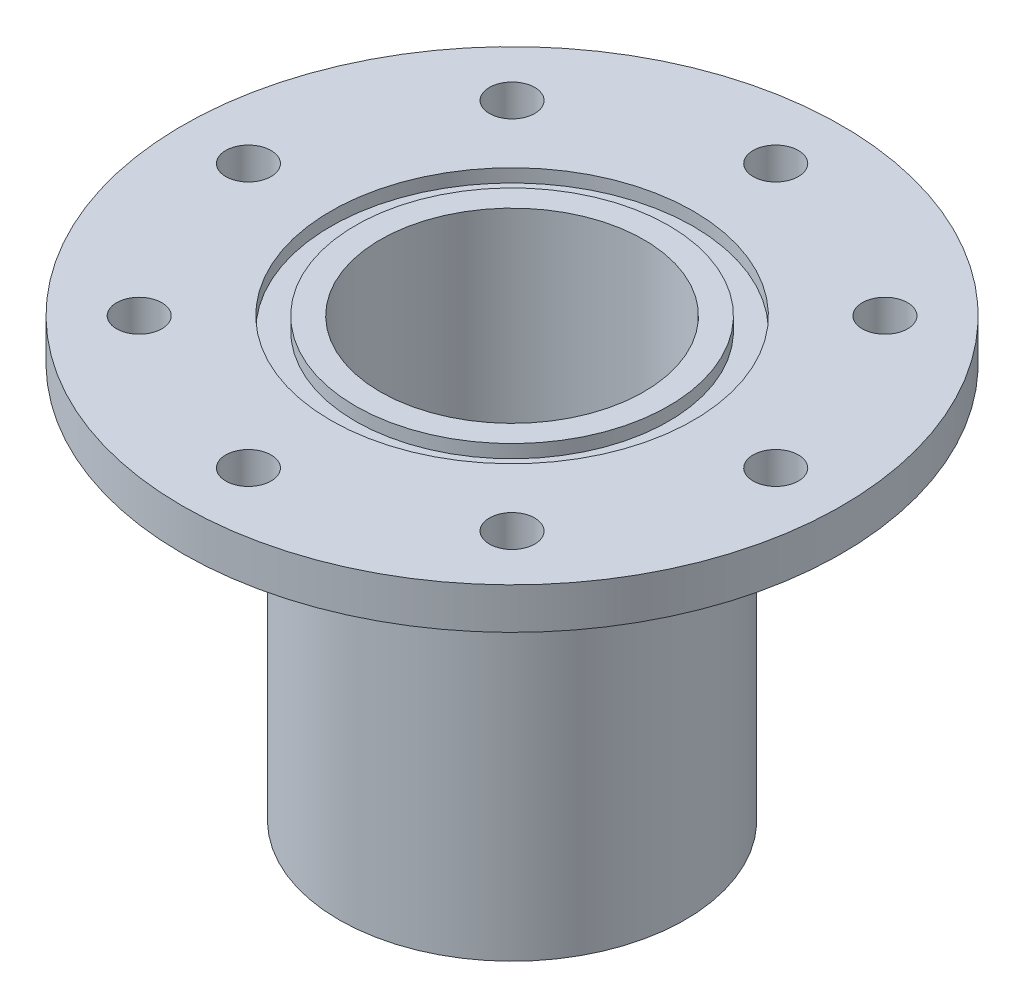
ISO-10303-21;
HEADER;
FILE_DESCRIPTION(('STEP AP214'),'2;1');
FILE_NAME('part.step','',(''),(''),'','','');
FILE_SCHEMA(('AUTOMOTIVE_DESIGN { 1 0 10303 214 1 1 1 1 }'));
ENDSEC;
DATA;
#1=APPLICATION_CONTEXT('core data for automotive mechanical design processes');
#2=APPLICATION_PROTOCOL_DEFINITION('international standard','automotive_design',2000,#1);
#3=PRODUCT_CONTEXT('',#1,'mechanical');
#4=PRODUCT('Part','Part','',(#3));
#5=PRODUCT_RELATED_PRODUCT_CATEGORY('part','',(#4));
#6=PRODUCT_DEFINITION_FORMATION('','',#4);
#7=PRODUCT_DEFINITION_CONTEXT('part definition',#1,'design');
#8=PRODUCT_DEFINITION('design','',#6,#7);
#9=PRODUCT_DEFINITION_SHAPE('','',#8);
#10=(LENGTH_UNIT() NAMED_UNIT(*) SI_UNIT(.MILLI.,.METRE.));
#11=(NAMED_UNIT(*) PLANE_ANGLE_UNIT() SI_UNIT($,.RADIAN.));
#12=(NAMED_UNIT(*) SI_UNIT($,.STERADIAN.) SOLID_ANGLE_UNIT());
#13=UNCERTAINTY_MEASURE_WITH_UNIT(LENGTH_MEASURE(1.E-05),#10,'distance_accuracy_value','');
#14=(GEOMETRIC_REPRESENTATION_CONTEXT(3) GLOBAL_UNCERTAINTY_ASSIGNED_CONTEXT((#13)) GLOBAL_UNIT_ASSIGNED_CONTEXT((#10,
#11,#12)) REPRESENTATION_CONTEXT('',''));
#15=CARTESIAN_POINT('',(0.,0.,0.));
#16=DIRECTION('',(0.,0.,1.));
#17=DIRECTION('',(1.,0.,0.));
#18=AXIS2_PLACEMENT_3D('',#15,#16,#17);
#19=CARTESIAN_POINT('',(0.,66.3320999570999,0.));
#20=DIRECTION('',(0.,1.,0.));
#21=DIRECTION('',(0.,0.,1.));
#22=AXIS2_PLACEMENT_3D('',#19,#20,#21);
#23=CYLINDRICAL_SURFACE('',#22,50.8);
#24=CARTESIAN_POINT('',(0.,-152.4,0.));
#25=DIRECTION('',(0.,1.,0.));
#26=DIRECTION('',(0.,0.,1.));
#27=AXIS2_PLACEMENT_3D('',#24,#25,#26);
#28=CIRCLE('',#27,50.8);
#29=CARTESIAN_POINT('',(0.,-152.4,50.8));
#30=VERTEX_POINT('',#29);
#31=EDGE_CURVE('E51',#30,#30,#28,.T.);
#32=ORIENTED_EDGE('',*,*,#31,.F.);
#33=EDGE_LOOP('',(#32));
#34=FACE_BOUND('',#33,.T.);
#35=CARTESIAN_POINT('',(0.,15.875,0.));
#36=DIRECTION('',(0.,1.,0.));
#37=DIRECTION('',(0.,0.,1.));
#38=AXIS2_PLACEMENT_3D('',#35,#36,#37);
#39=CIRCLE('',#38,50.8);
#40=CARTESIAN_POINT('',(0.,15.875,50.8));
#41=VERTEX_POINT('',#40);
#42=EDGE_CURVE('E44',#41,#41,#39,.T.);
#43=ORIENTED_EDGE('',*,*,#42,.T.);
#44=EDGE_LOOP('',(#43));
#45=FACE_BOUND('',#44,.T.);
#46=ADVANCED_FACE('F32',(#34,#45),#23,.F.);
#47=CARTESIAN_POINT('',(50.8,15.875,0.));
#48=DIRECTION('',(0.,-1.,0.));
#49=DIRECTION('',(0.,0.,-1.));
#50=AXIS2_PLACEMENT_3D('',#47,#48,#49);
#51=PLANE('',#50);
#52=ORIENTED_EDGE('',*,*,#42,.F.);
#53=EDGE_LOOP('',(#52));
#54=FACE_BOUND('',#53,.T.);
#55=CARTESIAN_POINT('',(0.,15.875,0.));
#56=DIRECTION('',(0.,1.,0.));
#57=DIRECTION('',(0.,0.,1.));
#58=AXIS2_PLACEMENT_3D('',#55,#56,#57);
#59=CIRCLE('',#58,60.325);
#60=CARTESIAN_POINT('',(0.,15.875,60.325));
#61=VERTEX_POINT('',#60);
#62=EDGE_CURVE('E117',#61,#61,#59,.T.);
#63=ORIENTED_EDGE('',*,*,#62,.T.);
#64=EDGE_LOOP('',(#63));
#65=FACE_BOUND('',#64,.T.);
#66=ADVANCED_FACE('F123',(#54,#65),#51,.F.);
#67=CARTESIAN_POINT('',(0.,66.3320999570999,0.));
#68=DIRECTION('',(0.,1.,0.));
#69=DIRECTION('',(0.,0.,1.));
#70=AXIS2_PLACEMENT_3D('',#67,#68,#69);
#71=CYLINDRICAL_SURFACE('',#70,60.325);
#72=ORIENTED_EDGE('',*,*,#62,.F.);
#73=EDGE_LOOP('',(#72));
#74=FACE_BOUND('',#73,.T.);
#75=CARTESIAN_POINT('',(0.,10.795,0.));
#76=DIRECTION('',(0.,1.,0.));
#77=DIRECTION('',(0.,0.,1.));
#78=AXIS2_PLACEMENT_3D('',#75,#76,#77);
#79=CIRCLE('',#78,60.325);
#80=CARTESIAN_POINT('',(0.,10.795,60.325));
#81=VERTEX_POINT('',#80);
#82=EDGE_CURVE('E114',#81,#81,#79,.T.);
#83=ORIENTED_EDGE('',*,*,#82,.T.);
#84=EDGE_LOOP('',(#83));
#85=FACE_BOUND('',#84,.T.);
#86=ADVANCED_FACE('F126',(#74,#85),#71,.T.);
#87=CARTESIAN_POINT('',(60.325,10.795,0.));
#88=DIRECTION('',(0.,-1.,0.));
#89=DIRECTION('',(0.,0.,-1.));
#90=AXIS2_PLACEMENT_3D('',#87,#88,#89);
#91=PLANE('',#90);
#92=ORIENTED_EDGE('',*,*,#82,.F.);
#93=EDGE_LOOP('',(#92));
#94=FACE_BOUND('',#93,.T.);
#95=CARTESIAN_POINT('',(0.,10.795,0.));
#96=DIRECTION('',(0.,1.,0.));
#97=DIRECTION('',(0.,0.,1.));
#98=AXIS2_PLACEMENT_3D('',#95,#96,#97);
#99=CIRCLE('',#98,69.85);
#100=CARTESIAN_POINT('',(0.,10.795,69.85));
#101=VERTEX_POINT('',#100);
#102=EDGE_CURVE('E111',#101,#101,#99,.T.);
#103=ORIENTED_EDGE('',*,*,#102,.T.);
#104=EDGE_LOOP('',(#103));
#105=FACE_BOUND('',#104,.T.);
#106=ADVANCED_FACE('F131',(#94,#105),#91,.F.);
#107=CARTESIAN_POINT('',(0.,66.3320999570999,0.));
#108=DIRECTION('',(0.,1.,0.));
#109=DIRECTION('',(0.,0.,1.));
#110=AXIS2_PLACEMENT_3D('',#107,#108,#109);
#111=CYLINDRICAL_SURFACE('',#110,69.85);
#112=ORIENTED_EDGE('',*,*,#102,.F.);
#113=EDGE_LOOP('',(#112));
#114=FACE_BOUND('',#113,.T.);
#115=CARTESIAN_POINT('',(0.,15.875,0.));
#116=DIRECTION('',(0.,1.,0.));
#117=DIRECTION('',(0.,0.,1.));
#118=AXIS2_PLACEMENT_3D('',#115,#116,#117);
#119=CIRCLE('',#118,69.85);
#120=CARTESIAN_POINT('',(0.,15.875,69.85));
#121=VERTEX_POINT('',#120);
#122=EDGE_CURVE('E108',#121,#121,#119,.T.);
#123=ORIENTED_EDGE('',*,*,#122,.T.);
#124=EDGE_LOOP('',(#123));
#125=FACE_BOUND('',#124,.T.);
#126=ADVANCED_FACE('F137',(#114,#125),#111,.F.);
#127=CARTESIAN_POINT('',(127.,15.875,0.));
#128=DIRECTION('',(0.,-1.,0.));
#129=DIRECTION('',(0.,0.,-1.));
#130=AXIS2_PLACEMENT_3D('',#127,#128,#129);
#131=PLANE('',#130);
#132=CARTESIAN_POINT('',(71.8420489685524,15.875,-71.8420489685541));
#133=DIRECTION('',(0.,1.,0.));
#134=DIRECTION('',(0.,0.,1.));
#135=AXIS2_PLACEMENT_3D('',#132,#133,#134);
#136=CIRCLE('',#135,8.73124999999998);
#137=CARTESIAN_POINT('',(71.8420489685524,15.875,-63.1107989685541));
#138=VERTEX_POINT('',#137);
#139=EDGE_CURVE('E84',#138,#138,#136,.T.);
#140=ORIENTED_EDGE('',*,*,#139,.F.);
#141=EDGE_LOOP('',(#140));
#142=FACE_BOUND('',#141,.T.);
#143=CARTESIAN_POINT('',(101.6,15.875,-1.06420412846614E-12));
#144=DIRECTION('',(0.,1.,0.));
#145=DIRECTION('',(0.,0.,1.));
#146=AXIS2_PLACEMENT_3D('',#143,#144,#145);
#147=CIRCLE('',#146,8.73124999999998);
#148=CARTESIAN_POINT('',(101.6,15.875,8.73124999999892));
#149=VERTEX_POINT('',#148);
#150=EDGE_CURVE('E74',#149,#149,#147,.T.);
#151=ORIENTED_EDGE('',*,*,#150,.F.);
#152=EDGE_LOOP('',(#151));
#153=FACE_BOUND('',#152,.T.);
#154=CARTESIAN_POINT('',(71.8420489685539,15.875,71.8420489685526));
#155=DIRECTION('',(0.,1.,0.));
#156=DIRECTION('',(0.,0.,1.));
#157=AXIS2_PLACEMENT_3D('',#154,#155,#156);
#158=CIRCLE('',#157,8.73124999999998);
#159=CARTESIAN_POINT('',(71.8420489685539,15.875,80.5732989685526));
#160=VERTEX_POINT('',#159);
#161=EDGE_CURVE('E71',#160,#160,#158,.T.);
#162=ORIENTED_EDGE('',*,*,#161,.F.);
#163=EDGE_LOOP('',(#162));
#164=FACE_BOUND('',#163,.T.);
#165=CARTESIAN_POINT('',(7.09469418977426E-13,15.875,101.6));
#166=DIRECTION('',(0.,1.,0.));
#167=DIRECTION('',(0.,0.,1.));
#168=AXIS2_PLACEMENT_3D('',#165,#166,#167);
#169=CIRCLE('',#168,8.73124999999999);
#170=CARTESIAN_POINT('',(7.09469418977426E-13,15.875,110.33125));
#171=VERTEX_POINT('',#170);
#172=EDGE_CURVE('E68',#171,#171,#169,.T.);
#173=ORIENTED_EDGE('',*,*,#172,.F.);
#174=EDGE_LOOP('',(#173));
#175=FACE_BOUND('',#174,.T.);
#176=CARTESIAN_POINT('',(-71.8420489685528,15.875,71.8420489685536));
#177=DIRECTION('',(0.,1.,0.));
#178=DIRECTION('',(0.,0.,1.));
#179=AXIS2_PLACEMENT_3D('',#176,#177,#178);
#180=CIRCLE('',#179,8.73124999999998);
#181=CARTESIAN_POINT('',(-71.8420489685528,15.875,80.5732989685536));
#182=VERTEX_POINT('',#181);
#183=EDGE_CURVE('E64',#182,#182,#180,.T.);
#184=ORIENTED_EDGE('',*,*,#183,.F.);
#185=EDGE_LOOP('',(#184));
#186=FACE_BOUND('',#185,.T.);
#187=CARTESIAN_POINT('',(-101.6,15.875,3.54734709488713E-13));
#188=DIRECTION('',(0.,1.,0.));
#189=DIRECTION('',(0.,0.,1.));
#190=AXIS2_PLACEMENT_3D('',#187,#188,#189);
#191=CIRCLE('',#190,8.73124999999998);
#192=CARTESIAN_POINT('',(-101.6,15.875,8.73125000000034));
#193=VERTEX_POINT('',#192);
#194=EDGE_CURVE('E60',#193,#193,#191,.T.);
#195=ORIENTED_EDGE('',*,*,#194,.F.);
#196=EDGE_LOOP('',(#195));
#197=FACE_BOUND('',#196,.T.);
#198=CARTESIAN_POINT('',(-71.8420489685534,15.875,-71.8420489685531));
#199=DIRECTION('',(0.,1.,0.));
#200=DIRECTION('',(0.,0.,1.));
#201=AXIS2_PLACEMENT_3D('',#198,#199,#200);
#202=CIRCLE('',#201,8.73124999999998);
#203=CARTESIAN_POINT('',(-71.8420489685534,15.875,-63.1107989685531));
#204=VERTEX_POINT('',#203);
#205=EDGE_CURVE('E56',#204,#204,#202,.T.);
#206=ORIENTED_EDGE('',*,*,#205,.F.);
#207=EDGE_LOOP('',(#206));
#208=FACE_BOUND('',#207,.T.);
#209=CARTESIAN_POINT('',(0.,15.875,-101.6));
#210=DIRECTION('',(0.,1.,0.));
#211=DIRECTION('',(0.,0.,1.));
#212=AXIS2_PLACEMENT_3D('',#209,#210,#211);
#213=CIRCLE('',#212,8.73124999999999);
#214=CARTESIAN_POINT('',(0.,15.875,-92.86875));
#215=VERTEX_POINT('',#214);
#216=EDGE_CURVE('E52',#215,#215,#213,.T.);
#217=ORIENTED_EDGE('',*,*,#216,.F.);
#218=EDGE_LOOP('',(#217));
#219=FACE_BOUND('',#218,.T.);
#220=ORIENTED_EDGE('',*,*,#122,.F.);
#221=EDGE_LOOP('',(#220));
#222=FACE_BOUND('',#221,.T.);
#223=CARTESIAN_POINT('',(0.,15.875,0.));
#224=DIRECTION('',(0.,1.,0.));
#225=DIRECTION('',(0.,0.,1.));
#226=AXIS2_PLACEMENT_3D('',#223,#224,#225);
#227=CIRCLE('',#226,127.);
#228=CARTESIAN_POINT('',(0.,15.875,127.));
#229=VERTEX_POINT('',#228);
#230=EDGE_CURVE('E105',#229,#229,#227,.T.);
#231=ORIENTED_EDGE('',*,*,#230,.T.);
#232=EDGE_LOOP('',(#231));
#233=FACE_BOUND('',#232,.T.);
#234=ADVANCED_FACE('F143',(#142,#153,#164,#175,#186,#197,#208,#219,#222,#233),#131,.F.);
#235=CARTESIAN_POINT('',(0.,66.3320999570999,0.));
#236=DIRECTION('',(0.,1.,0.));
#237=DIRECTION('',(0.,0.,1.));
#238=AXIS2_PLACEMENT_3D('',#235,#236,#237);
#239=CYLINDRICAL_SURFACE('',#238,127.);
#240=ORIENTED_EDGE('',*,*,#230,.F.);
#241=EDGE_LOOP('',(#240));
#242=FACE_BOUND('',#241,.T.);
#243=CARTESIAN_POINT('',(0.,0.,0.));
#244=DIRECTION('',(0.,1.,0.));
#245=DIRECTION('',(0.,0.,1.));
#246=AXIS2_PLACEMENT_3D('',#243,#244,#245);
#247=CIRCLE('',#246,127.);
#248=CARTESIAN_POINT('',(0.,0.,127.));
#249=VERTEX_POINT('',#248);
#250=EDGE_CURVE('E102',#249,#249,#247,.T.);
#251=ORIENTED_EDGE('',*,*,#250,.T.);
#252=EDGE_LOOP('',(#251));
#253=FACE_BOUND('',#252,.T.);
#254=ADVANCED_FACE('F149',(#242,#253),#239,.T.);
#255=CARTESIAN_POINT('',(66.675,0.,0.));
#256=DIRECTION('',(0.,1.,0.));
#257=DIRECTION('',(0.,0.,1.));
#258=AXIS2_PLACEMENT_3D('',#255,#256,#257);
#259=PLANE('',#258);
#260=CARTESIAN_POINT('',(71.8420489685524,0.,-71.8420489685541));
#261=DIRECTION('',(0.,1.,0.));
#262=DIRECTION('',(0.,0.,1.));
#263=AXIS2_PLACEMENT_3D('',#260,#261,#262);
#264=CIRCLE('',#263,8.73124999999997);
#265=CARTESIAN_POINT('',(71.8420489685524,0.,-63.1107989685541));
#266=VERTEX_POINT('',#265);
#267=EDGE_CURVE('E35',#266,#266,#264,.T.);
#268=ORIENTED_EDGE('',*,*,#267,.T.);
#269=EDGE_LOOP('',(#268));
#270=FACE_BOUND('',#269,.T.);
#271=CARTESIAN_POINT('',(101.6,0.,-1.06420412846614E-12));
#272=DIRECTION('',(0.,1.,0.));
#273=DIRECTION('',(0.,0.,1.));
#274=AXIS2_PLACEMENT_3D('',#271,#272,#273);
#275=CIRCLE('',#274,8.73124999999996);
#276=CARTESIAN_POINT('',(101.6,0.,8.7312499999989));
#277=VERTEX_POINT('',#276);
#278=EDGE_CURVE('E72',#277,#277,#275,.T.);
#279=ORIENTED_EDGE('',*,*,#278,.T.);
#280=EDGE_LOOP('',(#279));
#281=FACE_BOUND('',#280,.T.);
#282=CARTESIAN_POINT('',(71.8420489685539,0.,71.8420489685526));
#283=DIRECTION('',(0.,1.,0.));
#284=DIRECTION('',(0.,0.,1.));
#285=AXIS2_PLACEMENT_3D('',#282,#283,#284);
#286=CIRCLE('',#285,8.73124999999997);
#287=CARTESIAN_POINT('',(71.8420489685539,0.,80.5732989685526));
#288=VERTEX_POINT('',#287);
#289=EDGE_CURVE('E69',#288,#288,#286,.T.);
#290=ORIENTED_EDGE('',*,*,#289,.T.);
#291=EDGE_LOOP('',(#290));
#292=FACE_BOUND('',#291,.T.);
#293=CARTESIAN_POINT('',(7.09469418977426E-13,0.,101.6));
#294=DIRECTION('',(0.,1.,0.));
#295=DIRECTION('',(0.,0.,1.));
#296=AXIS2_PLACEMENT_3D('',#293,#294,#295);
#297=CIRCLE('',#296,8.73124999999997);
#298=CARTESIAN_POINT('',(7.09469418977426E-13,0.,110.33125));
#299=VERTEX_POINT('',#298);
#300=EDGE_CURVE('E65',#299,#299,#297,.T.);
#301=ORIENTED_EDGE('',*,*,#300,.T.);
#302=EDGE_LOOP('',(#301));
#303=FACE_BOUND('',#302,.T.);
#304=CARTESIAN_POINT('',(-71.8420489685528,0.,71.8420489685536));
#305=DIRECTION('',(0.,1.,0.));
#306=DIRECTION('',(0.,0.,1.));
#307=AXIS2_PLACEMENT_3D('',#304,#305,#306);
#308=CIRCLE('',#307,8.73124999999996);
#309=CARTESIAN_POINT('',(-71.8420489685528,0.,80.5732989685536));
#310=VERTEX_POINT('',#309);
#311=EDGE_CURVE('E61',#310,#310,#308,.T.);
#312=ORIENTED_EDGE('',*,*,#311,.T.);
#313=EDGE_LOOP('',(#312));
#314=FACE_BOUND('',#313,.T.);
#315=CARTESIAN_POINT('',(-101.6,0.,3.54734709488713E-13));
#316=DIRECTION('',(0.,1.,0.));
#317=DIRECTION('',(0.,0.,1.));
#318=AXIS2_PLACEMENT_3D('',#315,#316,#317);
#319=CIRCLE('',#318,8.73124999999996);
#320=CARTESIAN_POINT('',(-101.6,0.,8.73125000000032));
#321=VERTEX_POINT('',#320);
#322=EDGE_CURVE('E57',#321,#321,#319,.T.);
#323=ORIENTED_EDGE('',*,*,#322,.T.);
#324=EDGE_LOOP('',(#323));
#325=FACE_BOUND('',#324,.T.);
#326=CARTESIAN_POINT('',(-71.8420489685534,0.,-71.8420489685531));
#327=DIRECTION('',(0.,1.,0.));
#328=DIRECTION('',(0.,0.,1.));
#329=AXIS2_PLACEMENT_3D('',#326,#327,#328);
#330=CIRCLE('',#329,8.73124999999997);
#331=CARTESIAN_POINT('',(-71.8420489685534,0.,-63.1107989685531));
#332=VERTEX_POINT('',#331);
#333=EDGE_CURVE('E53',#332,#332,#330,.T.);
#334=ORIENTED_EDGE('',*,*,#333,.T.);
#335=EDGE_LOOP('',(#334));
#336=FACE_BOUND('',#335,.T.);
#337=CARTESIAN_POINT('',(0.,0.,-101.6));
#338=DIRECTION('',(0.,1.,0.));
#339=DIRECTION('',(0.,0.,1.));
#340=AXIS2_PLACEMENT_3D('',#337,#338,#339);
#341=CIRCLE('',#340,8.73124999999997);
#342=CARTESIAN_POINT('',(0.,0.,-92.86875));
#343=VERTEX_POINT('',#342);
#344=EDGE_CURVE('E48',#343,#343,#341,.T.);
#345=ORIENTED_EDGE('',*,*,#344,.T.);
#346=EDGE_LOOP('',(#345));
#347=FACE_BOUND('',#346,.T.);
#348=CARTESIAN_POINT('',(0.,0.,0.));
#349=DIRECTION('',(0.,1.,0.));
#350=DIRECTION('',(0.,0.,1.));
#351=AXIS2_PLACEMENT_3D('',#348,#349,#350);
#352=CIRCLE('',#351,76.835);
#353=CARTESIAN_POINT('',(0.,0.,76.835));
#354=VERTEX_POINT('',#353);
#355=EDGE_CURVE('E39',#354,#354,#352,.T.);
#356=ORIENTED_EDGE('',*,*,#355,.T.);
#357=EDGE_LOOP('',(#356));
#358=FACE_BOUND('',#357,.T.);
#359=ORIENTED_EDGE('',*,*,#250,.F.);
#360=EDGE_LOOP('',(#359));
#361=FACE_BOUND('',#360,.T.);
#362=ADVANCED_FACE('F156',(#270,#281,#292,#303,#314,#325,#336,#347,#358,#361),#259,.F.);
#363=CARTESIAN_POINT('',(0.,66.3320999570999,0.));
#364=DIRECTION('',(0.,1.,0.));
#365=DIRECTION('',(0.,0.,1.));
#366=AXIS2_PLACEMENT_3D('',#363,#364,#365);
#367=CYLINDRICAL_SURFACE('',#366,66.675);
#368=CARTESIAN_POINT('',(0.,-10.16,0.));
#369=DIRECTION('',(0.,1.,0.));
#370=DIRECTION('',(0.,0.,1.));
#371=AXIS2_PLACEMENT_3D('',#368,#369,#370);
#372=CIRCLE('',#371,66.675);
#373=CARTESIAN_POINT('',(0.,-10.16,66.675));
#374=VERTEX_POINT('',#373);
#375=EDGE_CURVE('E10',#374,#374,#372,.F.);
#376=ORIENTED_EDGE('',*,*,#375,.T.);
#377=EDGE_LOOP('',(#376));
#378=FACE_BOUND('',#377,.T.);
#379=CARTESIAN_POINT('',(0.,-152.4,0.));
#380=DIRECTION('',(0.,1.,0.));
#381=DIRECTION('',(0.,0.,1.));
#382=AXIS2_PLACEMENT_3D('',#379,#380,#381);
#383=CIRCLE('',#382,66.675);
#384=CARTESIAN_POINT('',(0.,-152.4,66.675));
#385=VERTEX_POINT('',#384);
#386=EDGE_CURVE('E99',#385,#385,#383,.T.);
#387=ORIENTED_EDGE('',*,*,#386,.T.);
#388=EDGE_LOOP('',(#387));
#389=FACE_BOUND('',#388,.T.);
#390=ADVANCED_FACE('F161',(#378,#389),#367,.T.);
#391=CARTESIAN_POINT('',(50.8,-152.4,0.));
#392=DIRECTION('',(0.,1.,0.));
#393=DIRECTION('',(0.,0.,1.));
#394=AXIS2_PLACEMENT_3D('',#391,#392,#393);
#395=PLANE('',#394);
#396=ORIENTED_EDGE('',*,*,#386,.F.);
#397=EDGE_LOOP('',(#396));
#398=FACE_BOUND('',#397,.T.);
#399=ORIENTED_EDGE('',*,*,#31,.T.);
#400=EDGE_LOOP('',(#399));
#401=FACE_BOUND('',#400,.T.);
#402=ADVANCED_FACE('F167',(#398,#401),#395,.F.);
#403=CARTESIAN_POINT('',(0.,-10.16,0.));
#404=DIRECTION('',(0.,1.,0.));
#405=DIRECTION('',(0.,0.,1.));
#406=AXIS2_PLACEMENT_3D('',#403,#404,#405);
#407=TOROIDAL_SURFACE('',#406,76.835,10.16);
#408=ORIENTED_EDGE('',*,*,#375,.F.);
#409=EDGE_LOOP('',(#408));
#410=FACE_BOUND('',#409,.T.);
#411=ORIENTED_EDGE('',*,*,#355,.F.);
#412=EDGE_LOOP('',(#411));
#413=FACE_BOUND('',#412,.T.);
#414=ADVANCED_FACE('F176',(#410,#413),#407,.F.);
#415=CARTESIAN_POINT('',(0.,15.875,-101.6));
#416=DIRECTION('',(0.,1.,0.));
#417=DIRECTION('',(0.,0.,1.));
#418=AXIS2_PLACEMENT_3D('',#415,#416,#417);
#419=CYLINDRICAL_SURFACE('',#418,8.73124999999997);
#420=ORIENTED_EDGE('',*,*,#216,.T.);
#421=EDGE_LOOP('',(#420));
#422=FACE_BOUND('',#421,.T.);
#423=ORIENTED_EDGE('',*,*,#344,.F.);
#424=EDGE_LOOP('',(#423));
#425=FACE_BOUND('',#424,.T.);
#426=ADVANCED_FACE('F182',(#422,#425),#419,.F.);
#427=CARTESIAN_POINT('',(-71.8420489685534,15.875,-71.8420489685531));
#428=DIRECTION('',(0.,1.,0.));
#429=DIRECTION('',(0.,0.,1.));
#430=AXIS2_PLACEMENT_3D('',#427,#428,#429);
#431=CYLINDRICAL_SURFACE('',#430,8.73124999999997);
#432=ORIENTED_EDGE('',*,*,#205,.T.);
#433=EDGE_LOOP('',(#432));
#434=FACE_BOUND('',#433,.T.);
#435=ORIENTED_EDGE('',*,*,#333,.F.);
#436=EDGE_LOOP('',(#435));
#437=FACE_BOUND('',#436,.T.);
#438=ADVANCED_FACE('F189',(#434,#437),#431,.F.);
#439=CARTESIAN_POINT('',(-101.6,15.875,3.54734709488713E-13));
#440=DIRECTION('',(0.,1.,0.));
#441=DIRECTION('',(0.,0.,1.));
#442=AXIS2_PLACEMENT_3D('',#439,#440,#441);
#443=CYLINDRICAL_SURFACE('',#442,8.73124999999996);
#444=ORIENTED_EDGE('',*,*,#194,.T.);
#445=EDGE_LOOP('',(#444));
#446=FACE_BOUND('',#445,.T.);
#447=ORIENTED_EDGE('',*,*,#322,.F.);
#448=EDGE_LOOP('',(#447));
#449=FACE_BOUND('',#448,.T.);
#450=ADVANCED_FACE('F193',(#446,#449),#443,.F.);
#451=CARTESIAN_POINT('',(-71.8420489685528,15.875,71.8420489685536));
#452=DIRECTION('',(0.,1.,0.));
#453=DIRECTION('',(0.,0.,1.));
#454=AXIS2_PLACEMENT_3D('',#451,#452,#453);
#455=CYLINDRICAL_SURFACE('',#454,8.73124999999996);
#456=ORIENTED_EDGE('',*,*,#183,.T.);
#457=EDGE_LOOP('',(#456));
#458=FACE_BOUND('',#457,.T.);
#459=ORIENTED_EDGE('',*,*,#311,.F.);
#460=EDGE_LOOP('',(#459));
#461=FACE_BOUND('',#460,.T.);
#462=ADVANCED_FACE('F197',(#458,#461),#455,.F.);
#463=CARTESIAN_POINT('',(7.09469418977426E-13,15.875,101.6));
#464=DIRECTION('',(0.,1.,0.));
#465=DIRECTION('',(0.,0.,1.));
#466=AXIS2_PLACEMENT_3D('',#463,#464,#465);
#467=CYLINDRICAL_SURFACE('',#466,8.73124999999997);
#468=ORIENTED_EDGE('',*,*,#172,.T.);
#469=EDGE_LOOP('',(#468));
#470=FACE_BOUND('',#469,.T.);
#471=ORIENTED_EDGE('',*,*,#300,.F.);
#472=EDGE_LOOP('',(#471));
#473=FACE_BOUND('',#472,.T.);
#474=ADVANCED_FACE('F201',(#470,#473),#467,.F.);
#475=CARTESIAN_POINT('',(71.8420489685539,15.875,71.8420489685526));
#476=DIRECTION('',(0.,1.,0.));
#477=DIRECTION('',(0.,0.,1.));
#478=AXIS2_PLACEMENT_3D('',#475,#476,#477);
#479=CYLINDRICAL_SURFACE('',#478,8.73124999999997);
#480=ORIENTED_EDGE('',*,*,#161,.T.);
#481=EDGE_LOOP('',(#480));
#482=FACE_BOUND('',#481,.T.);
#483=ORIENTED_EDGE('',*,*,#289,.F.);
#484=EDGE_LOOP('',(#483));
#485=FACE_BOUND('',#484,.T.);
#486=ADVANCED_FACE('F205',(#482,#485),#479,.F.);
#487=CARTESIAN_POINT('',(101.6,15.875,-1.06420412846614E-12));
#488=DIRECTION('',(0.,1.,0.));
#489=DIRECTION('',(0.,0.,1.));
#490=AXIS2_PLACEMENT_3D('',#487,#488,#489);
#491=CYLINDRICAL_SURFACE('',#490,8.73124999999996);
#492=ORIENTED_EDGE('',*,*,#150,.T.);
#493=EDGE_LOOP('',(#492));
#494=FACE_BOUND('',#493,.T.);
#495=ORIENTED_EDGE('',*,*,#278,.F.);
#496=EDGE_LOOP('',(#495));
#497=FACE_BOUND('',#496,.T.);
#498=ADVANCED_FACE('F209',(#494,#497),#491,.F.);
#499=CARTESIAN_POINT('',(71.8420489685524,15.875,-71.8420489685541));
#500=DIRECTION('',(0.,1.,0.));
#501=DIRECTION('',(0.,0.,1.));
#502=AXIS2_PLACEMENT_3D('',#499,#500,#501);
#503=CYLINDRICAL_SURFACE('',#502,8.73124999999997);
#504=ORIENTED_EDGE('',*,*,#139,.T.);
#505=EDGE_LOOP('',(#504));
#506=FACE_BOUND('',#505,.T.);
#507=ORIENTED_EDGE('',*,*,#267,.F.);
#508=EDGE_LOOP('',(#507));
#509=FACE_BOUND('',#508,.T.);
#510=ADVANCED_FACE('F213',(#506,#509),#503,.F.);
#511=CLOSED_SHELL('',(#46,#66,#86,#106,#126,#234,#254,#362,#390,#402,#414,#426,#438,#450,#462,
#474,#486,#498,#510));
#512=MANIFOLD_SOLID_BREP('B2',#511);
#513=ADVANCED_BREP_SHAPE_REPRESENTATION('',(#18,#512),#14);
#514=SHAPE_DEFINITION_REPRESENTATION(#9,#513);
ENDSEC;
END-ISO-10303-21;
